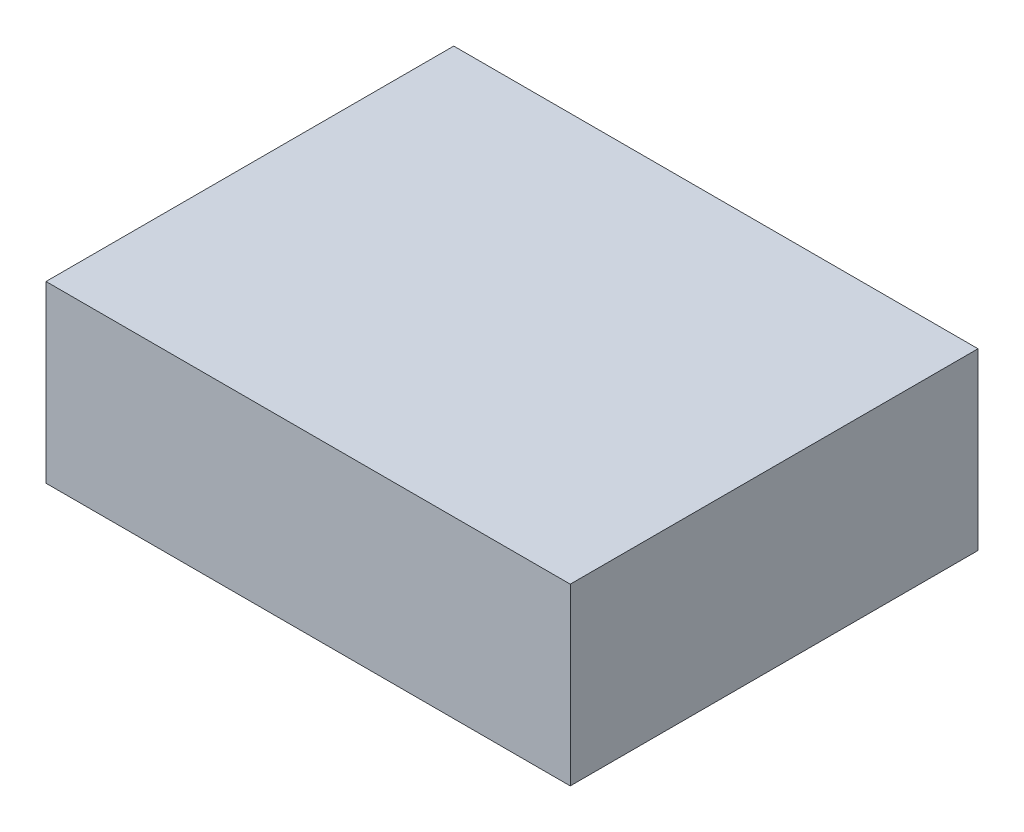
ISO-10303-21;
HEADER;
FILE_DESCRIPTION(('STEP AP214'),'2;1');
FILE_NAME('part.step','',(''),(''),'','','');
FILE_SCHEMA(('AUTOMOTIVE_DESIGN { 1 0 10303 214 1 1 1 1 }'));
ENDSEC;
DATA;
#1=APPLICATION_CONTEXT('core data for automotive mechanical design processes');
#2=APPLICATION_PROTOCOL_DEFINITION('international standard','automotive_design',2000,#1);
#3=PRODUCT_CONTEXT('',#1,'mechanical');
#4=PRODUCT('Part','Part','',(#3));
#5=PRODUCT_RELATED_PRODUCT_CATEGORY('part','',(#4));
#6=PRODUCT_DEFINITION_FORMATION('','',#4);
#7=PRODUCT_DEFINITION_CONTEXT('part definition',#1,'design');
#8=PRODUCT_DEFINITION('design','',#6,#7);
#9=PRODUCT_DEFINITION_SHAPE('','',#8);
#10=(LENGTH_UNIT() NAMED_UNIT(*) SI_UNIT(.MILLI.,.METRE.));
#11=(NAMED_UNIT(*) PLANE_ANGLE_UNIT() SI_UNIT($,.RADIAN.));
#12=(NAMED_UNIT(*) SI_UNIT($,.STERADIAN.) SOLID_ANGLE_UNIT());
#13=UNCERTAINTY_MEASURE_WITH_UNIT(LENGTH_MEASURE(1.E-05),#10,'distance_accuracy_value','');
#14=(GEOMETRIC_REPRESENTATION_CONTEXT(3) GLOBAL_UNCERTAINTY_ASSIGNED_CONTEXT((#13)) GLOBAL_UNIT_ASSIGNED_CONTEXT((#10,
#11,#12)) REPRESENTATION_CONTEXT('',''));
#15=CARTESIAN_POINT('',(0.,0.,0.));
#16=DIRECTION('',(0.,0.,1.));
#17=DIRECTION('',(1.,0.,0.));
#18=AXIS2_PLACEMENT_3D('',#15,#16,#17);
#19=CARTESIAN_POINT('',(0.,38.1,0.));
#20=DIRECTION('',(1.,0.,0.));
#21=DIRECTION('',(0.,0.,-1.));
#22=AXIS2_PLACEMENT_3D('',#19,#20,#21);
#23=PLANE('',#22);
#24=DIRECTION('',(0.,0.,1.));
#25=VECTOR('',#24,1.);
#26=CARTESIAN_POINT('',(0.,0.,0.));
#27=LINE('',#26,#25);
#28=CARTESIAN_POINT('',(0.,0.,-88.9));
#29=VERTEX_POINT('',#28);
#30=CARTESIAN_POINT('',(0.,0.,0.));
#31=VERTEX_POINT('',#30);
#32=EDGE_CURVE('E94',#29,#31,#27,.T.);
#33=ORIENTED_EDGE('',*,*,#32,.T.);
#34=DIRECTION('',(0.,-1.,0.));
#35=VECTOR('',#34,1.);
#36=CARTESIAN_POINT('',(0.,38.1,0.));
#37=LINE('',#36,#35);
#38=CARTESIAN_POINT('',(0.,38.1,0.));
#39=VERTEX_POINT('',#38);
#40=EDGE_CURVE('E11',#39,#31,#37,.T.);
#41=ORIENTED_EDGE('',*,*,#40,.F.);
#42=DIRECTION('',(0.,0.,1.));
#43=VECTOR('',#42,1.);
#44=CARTESIAN_POINT('',(0.,38.1,0.));
#45=LINE('',#44,#43);
#46=CARTESIAN_POINT('',(0.,38.1,-88.9));
#47=VERTEX_POINT('',#46);
#48=EDGE_CURVE('E82',#47,#39,#45,.T.);
#49=ORIENTED_EDGE('',*,*,#48,.F.);
#50=DIRECTION('',(0.,-1.,0.));
#51=VECTOR('',#50,1.);
#52=CARTESIAN_POINT('',(0.,38.1,-88.9));
#53=LINE('',#52,#51);
#54=EDGE_CURVE('E90',#47,#29,#53,.T.);
#55=ORIENTED_EDGE('',*,*,#54,.T.);
#56=EDGE_LOOP('',(#33,#41,#49,#55));
#57=FACE_BOUND('',#56,.T.);
#58=ADVANCED_FACE('F31',(#57),#23,.F.);
#59=CARTESIAN_POINT('',(0.,38.1,0.));
#60=DIRECTION('',(0.,0.,-1.));
#61=DIRECTION('',(-1.,0.,0.));
#62=AXIS2_PLACEMENT_3D('',#59,#60,#61);
#63=PLANE('',#62);
#64=DIRECTION('',(1.,0.,0.));
#65=VECTOR('',#64,1.);
#66=CARTESIAN_POINT('',(0.,0.,0.));
#67=LINE('',#66,#65);
#68=CARTESIAN_POINT('',(114.3,0.,0.));
#69=VERTEX_POINT('',#68);
#70=EDGE_CURVE('E86',#31,#69,#67,.T.);
#71=ORIENTED_EDGE('',*,*,#70,.T.);
#72=DIRECTION('',(0.,-1.,0.));
#73=VECTOR('',#72,1.);
#74=CARTESIAN_POINT('',(114.3,38.1,0.));
#75=LINE('',#74,#73);
#76=CARTESIAN_POINT('',(114.3,38.1,0.));
#77=VERTEX_POINT('',#76);
#78=EDGE_CURVE('E39',#77,#69,#75,.T.);
#79=ORIENTED_EDGE('',*,*,#78,.F.);
#80=DIRECTION('',(1.,0.,0.));
#81=VECTOR('',#80,1.);
#82=CARTESIAN_POINT('',(0.,38.1,0.));
#83=LINE('',#82,#81);
#84=EDGE_CURVE('E77',#39,#77,#83,.T.);
#85=ORIENTED_EDGE('',*,*,#84,.F.);
#86=ORIENTED_EDGE('',*,*,#40,.T.);
#87=EDGE_LOOP('',(#71,#79,#85,#86));
#88=FACE_BOUND('',#87,.T.);
#89=ADVANCED_FACE('F85',(#88),#63,.F.);
#90=CARTESIAN_POINT('',(114.3,38.1,0.));
#91=DIRECTION('',(-1.,0.,0.));
#92=DIRECTION('',(0.,0.,1.));
#93=AXIS2_PLACEMENT_3D('',#90,#91,#92);
#94=PLANE('',#93);
#95=DIRECTION('',(0.,0.,-1.));
#96=VECTOR('',#95,1.);
#97=CARTESIAN_POINT('',(114.3,0.,0.));
#98=LINE('',#97,#96);
#99=CARTESIAN_POINT('',(114.3,0.,-88.9));
#100=VERTEX_POINT('',#99);
#101=EDGE_CURVE('E64',#69,#100,#98,.T.);
#102=ORIENTED_EDGE('',*,*,#101,.T.);
#103=DIRECTION('',(0.,-1.,0.));
#104=VECTOR('',#103,1.);
#105=CARTESIAN_POINT('',(114.3,38.1,-88.9));
#106=LINE('',#105,#104);
#107=CARTESIAN_POINT('',(114.3,38.1,-88.9));
#108=VERTEX_POINT('',#107);
#109=EDGE_CURVE('E87',#108,#100,#106,.T.);
#110=ORIENTED_EDGE('',*,*,#109,.F.);
#111=DIRECTION('',(0.,0.,-1.));
#112=VECTOR('',#111,1.);
#113=CARTESIAN_POINT('',(114.3,38.1,0.));
#114=LINE('',#113,#112);
#115=EDGE_CURVE('E80',#77,#108,#114,.T.);
#116=ORIENTED_EDGE('',*,*,#115,.F.);
#117=ORIENTED_EDGE('',*,*,#78,.T.);
#118=EDGE_LOOP('',(#102,#110,#116,#117));
#119=FACE_BOUND('',#118,.T.);
#120=ADVANCED_FACE('F88',(#119),#94,.F.);
#121=CARTESIAN_POINT('',(0.,38.1,-88.9));
#122=DIRECTION('',(0.,0.,1.));
#123=DIRECTION('',(1.,0.,0.));
#124=AXIS2_PLACEMENT_3D('',#121,#122,#123);
#125=PLANE('',#124);
#126=DIRECTION('',(-1.,0.,0.));
#127=VECTOR('',#126,1.);
#128=CARTESIAN_POINT('',(0.,0.,-88.9));
#129=LINE('',#128,#127);
#130=EDGE_CURVE('E70',#100,#29,#129,.T.);
#131=ORIENTED_EDGE('',*,*,#130,.T.);
#132=ORIENTED_EDGE('',*,*,#54,.F.);
#133=DIRECTION('',(-1.,0.,0.));
#134=VECTOR('',#133,1.);
#135=CARTESIAN_POINT('',(0.,38.1,-88.9));
#136=LINE('',#135,#134);
#137=EDGE_CURVE('E47',#108,#47,#136,.T.);
#138=ORIENTED_EDGE('',*,*,#137,.F.);
#139=ORIENTED_EDGE('',*,*,#109,.T.);
#140=EDGE_LOOP('',(#131,#132,#138,#139));
#141=FACE_BOUND('',#140,.T.);
#142=ADVANCED_FACE('F101',(#141),#125,.F.);
#143=CARTESIAN_POINT('',(0.,38.1,-88.9));
#144=DIRECTION('',(0.,-1.,0.));
#145=DIRECTION('',(0.,0.,-1.));
#146=AXIS2_PLACEMENT_3D('',#143,#144,#145);
#147=PLANE('',#146);
#148=ORIENTED_EDGE('',*,*,#48,.T.);
#149=ORIENTED_EDGE('',*,*,#84,.T.);
#150=ORIENTED_EDGE('',*,*,#115,.T.);
#151=ORIENTED_EDGE('',*,*,#137,.T.);
#152=EDGE_LOOP('',(#148,#149,#150,#151));
#153=FACE_BOUND('',#152,.T.);
#154=ADVANCED_FACE('F78',(#153),#147,.F.);
#155=CARTESIAN_POINT('',(0.,0.,-88.9));
#156=DIRECTION('',(0.,-1.,0.));
#157=DIRECTION('',(0.,0.,-1.));
#158=AXIS2_PLACEMENT_3D('',#155,#156,#157);
#159=PLANE('',#158);
#160=ORIENTED_EDGE('',*,*,#32,.F.);
#161=ORIENTED_EDGE('',*,*,#130,.F.);
#162=ORIENTED_EDGE('',*,*,#101,.F.);
#163=ORIENTED_EDGE('',*,*,#70,.F.);
#164=EDGE_LOOP('',(#160,#161,#162,#163));
#165=FACE_BOUND('',#164,.T.);
#166=ADVANCED_FACE('F104',(#165),#159,.T.);
#167=CLOSED_SHELL('',(#58,#89,#120,#142,#154,#166));
#168=MANIFOLD_SOLID_BREP('B2',#167);
#169=ADVANCED_BREP_SHAPE_REPRESENTATION('',(#18,#168),#14);
#170=SHAPE_DEFINITION_REPRESENTATION(#9,#169);
ENDSEC;
END-ISO-10303-21;
